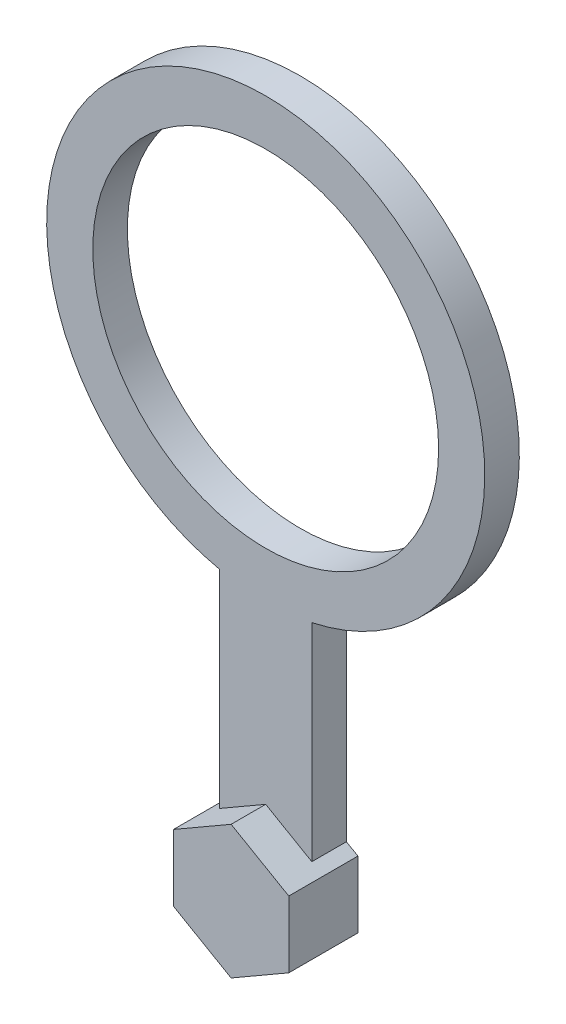
ISO-10303-21;
HEADER;
FILE_DESCRIPTION(('STEP AP214'),'2;1');
FILE_NAME('part.step','',(''),(''),'','','');
FILE_SCHEMA(('AUTOMOTIVE_DESIGN { 1 0 10303 214 1 1 1 1 }'));
ENDSEC;
DATA;
#1=APPLICATION_CONTEXT('core data for automotive mechanical design processes');
#2=APPLICATION_PROTOCOL_DEFINITION('international standard','automotive_design',2000,#1);
#3=PRODUCT_CONTEXT('',#1,'mechanical');
#4=PRODUCT('Part','Part','',(#3));
#5=PRODUCT_RELATED_PRODUCT_CATEGORY('part','',(#4));
#6=PRODUCT_DEFINITION_FORMATION('','',#4);
#7=PRODUCT_DEFINITION_CONTEXT('part definition',#1,'design');
#8=PRODUCT_DEFINITION('design','',#6,#7);
#9=PRODUCT_DEFINITION_SHAPE('','',#8);
#10=(LENGTH_UNIT() NAMED_UNIT(*) SI_UNIT(.MILLI.,.METRE.));
#11=(NAMED_UNIT(*) PLANE_ANGLE_UNIT() SI_UNIT($,.RADIAN.));
#12=(NAMED_UNIT(*) SI_UNIT($,.STERADIAN.) SOLID_ANGLE_UNIT());
#13=UNCERTAINTY_MEASURE_WITH_UNIT(LENGTH_MEASURE(1.E-05),#10,'distance_accuracy_value','');
#14=(GEOMETRIC_REPRESENTATION_CONTEXT(3) GLOBAL_UNCERTAINTY_ASSIGNED_CONTEXT((#13)) GLOBAL_UNIT_ASSIGNED_CONTEXT((#10,
#11,#12)) REPRESENTATION_CONTEXT('',''));
#15=CARTESIAN_POINT('',(0.,0.,0.));
#16=DIRECTION('',(0.,0.,1.));
#17=DIRECTION('',(1.,0.,0.));
#18=AXIS2_PLACEMENT_3D('',#15,#16,#17);
#19=CARTESIAN_POINT('',(5.,0.,3.));
#20=DIRECTION('',(-1.,0.,0.));
#21=DIRECTION('',(0.,-1.,0.));
#22=AXIS2_PLACEMENT_3D('',#19,#20,#21);
#23=PLANE('',#22);
#24=DIRECTION('',(0.,1.,0.));
#25=VECTOR('',#24,1.);
#26=CARTESIAN_POINT('',(5.,0.,0.));
#27=LINE('',#26,#25);
#28=CARTESIAN_POINT('',(5.,-2.88675134594813,0.));
#29=VERTEX_POINT('',#28);
#30=CARTESIAN_POINT('',(5.,2.88675134594813,0.));
#31=VERTEX_POINT('',#30);
#32=EDGE_CURVE('E169',#29,#31,#27,.T.);
#33=ORIENTED_EDGE('',*,*,#32,.T.);
#34=DIRECTION('',(0.,0.,-1.));
#35=VECTOR('',#34,1.);
#36=CARTESIAN_POINT('',(5.,2.88675134594813,3.));
#37=LINE('',#36,#35);
#38=CARTESIAN_POINT('',(5.,2.88675134594813,6.));
#39=VERTEX_POINT('',#38);
#40=EDGE_CURVE('E44',#39,#31,#37,.T.);
#41=ORIENTED_EDGE('',*,*,#40,.F.);
#42=DIRECTION('',(0.,1.,0.));
#43=VECTOR('',#42,1.);
#44=CARTESIAN_POINT('',(5.,-2.88675134594813,6.));
#45=LINE('',#44,#43);
#46=CARTESIAN_POINT('',(5.,-2.88675134594813,6.));
#47=VERTEX_POINT('',#46);
#48=EDGE_CURVE('E141',#47,#39,#45,.T.);
#49=ORIENTED_EDGE('',*,*,#48,.F.);
#50=DIRECTION('',(0.,0.,-1.));
#51=VECTOR('',#50,1.);
#52=CARTESIAN_POINT('',(5.,-2.88675134594813,3.));
#53=LINE('',#52,#51);
#54=EDGE_CURVE('E132',#47,#29,#53,.T.);
#55=ORIENTED_EDGE('',*,*,#54,.T.);
#56=EDGE_LOOP('',(#33,#41,#49,#55));
#57=FACE_BOUND('',#56,.T.);
#58=ADVANCED_FACE('F41',(#57),#23,.F.);
#59=CARTESIAN_POINT('',(2.5,4.3301270189222,3.));
#60=DIRECTION('',(-0.5,-0.866025403784439,0.));
#61=DIRECTION('',(0.866025403784439,-0.5,0.));
#62=AXIS2_PLACEMENT_3D('',#59,#60,#61);
#63=PLANE('',#62);
#64=DIRECTION('',(-0.866025403784439,0.5,0.));
#65=VECTOR('',#64,1.);
#66=CARTESIAN_POINT('',(2.5,4.3301270189222,0.));
#67=LINE('',#66,#65);
#68=CARTESIAN_POINT('',(4.,3.46410161513776,0.));
#69=VERTEX_POINT('',#68);
#70=EDGE_CURVE('E187',#31,#69,#67,.T.);
#71=ORIENTED_EDGE('',*,*,#70,.T.);
#72=DIRECTION('',(0.,0.,-1.));
#73=VECTOR('',#72,1.);
#74=CARTESIAN_POINT('',(4.,3.46410161513776,3.));
#75=LINE('',#74,#73);
#76=CARTESIAN_POINT('',(4.,3.46410161513776,3.));
#77=VERTEX_POINT('',#76);
#78=EDGE_CURVE('E230',#77,#69,#75,.T.);
#79=ORIENTED_EDGE('',*,*,#78,.F.);
#80=DIRECTION('',(-0.866025403784439,0.499999999999999,0.));
#81=VECTOR('',#80,1.);
#82=CARTESIAN_POINT('',(5.,2.88675134594813,3.));
#83=LINE('',#82,#81);
#84=CARTESIAN_POINT('',(0.,5.77350269189626,3.));
#85=VERTEX_POINT('',#84);
#86=EDGE_CURVE('E11',#77,#85,#83,.T.);
#87=ORIENTED_EDGE('',*,*,#86,.T.);
#88=DIRECTION('',(0.,0.,-1.));
#89=VECTOR('',#88,1.);
#90=CARTESIAN_POINT('',(0.,5.77350269189626,6.));
#91=LINE('',#90,#89);
#92=CARTESIAN_POINT('',(0.,5.77350269189626,6.));
#93=VERTEX_POINT('',#92);
#94=EDGE_CURVE('E164',#93,#85,#91,.T.);
#95=ORIENTED_EDGE('',*,*,#94,.F.);
#96=DIRECTION('',(-0.866025403784439,0.499999999999999,0.));
#97=VECTOR('',#96,1.);
#98=CARTESIAN_POINT('',(5.,2.88675134594813,6.));
#99=LINE('',#98,#97);
#100=EDGE_CURVE('E157',#39,#93,#99,.T.);
#101=ORIENTED_EDGE('',*,*,#100,.F.);
#102=ORIENTED_EDGE('',*,*,#40,.T.);
#103=EDGE_LOOP('',(#71,#79,#87,#95,#101,#102));
#104=FACE_BOUND('',#103,.T.);
#105=ADVANCED_FACE('F240',(#104),#63,.F.);
#106=CARTESIAN_POINT('',(4.,0.,3.));
#107=DIRECTION('',(-1.,0.,0.));
#108=DIRECTION('',(0.,-1.,0.));
#109=AXIS2_PLACEMENT_3D('',#106,#107,#108);
#110=PLANE('',#109);
#111=DIRECTION('',(0.,1.,0.));
#112=VECTOR('',#111,1.);
#113=CARTESIAN_POINT('',(4.,0.,0.));
#114=LINE('',#113,#112);
#115=CARTESIAN_POINT('',(4.,21.4258243789933,0.));
#116=VERTEX_POINT('',#115);
#117=EDGE_CURVE('E190',#69,#116,#114,.T.);
#118=ORIENTED_EDGE('',*,*,#117,.T.);
#119=DIRECTION('',(0.,0.,-1.));
#120=VECTOR('',#119,1.);
#121=CARTESIAN_POINT('',(4.,21.4258243789933,3.));
#122=LINE('',#121,#120);
#123=CARTESIAN_POINT('',(4.,21.4258243789933,3.));
#124=VERTEX_POINT('',#123);
#125=EDGE_CURVE('E227',#124,#116,#122,.T.);
#126=ORIENTED_EDGE('',*,*,#125,.F.);
#127=DIRECTION('',(0.,1.,0.));
#128=VECTOR('',#127,1.);
#129=CARTESIAN_POINT('',(4.,0.,3.));
#130=LINE('',#129,#128);
#131=EDGE_CURVE('E170',#77,#124,#130,.T.);
#132=ORIENTED_EDGE('',*,*,#131,.F.);
#133=ORIENTED_EDGE('',*,*,#78,.T.);
#134=EDGE_LOOP('',(#118,#126,#132,#133));
#135=FACE_BOUND('',#134,.T.);
#136=ADVANCED_FACE('F249',(#135),#110,.F.);
#137=CARTESIAN_POINT('',(0.,40.,3.));
#138=DIRECTION('',(0.,0.,-1.));
#139=DIRECTION('',(-1.,0.,0.));
#140=AXIS2_PLACEMENT_3D('',#137,#138,#139);
#141=CYLINDRICAL_SURFACE('',#140,19.);
#142=CARTESIAN_POINT('',(0.,40.,0.));
#143=DIRECTION('',(0.,0.,1.));
#144=DIRECTION('',(1.,0.,0.));
#145=AXIS2_PLACEMENT_3D('',#142,#143,#144);
#146=CIRCLE('',#145,19.);
#147=CARTESIAN_POINT('',(-4.,21.4258243789933,0.));
#148=VERTEX_POINT('',#147);
#149=EDGE_CURVE('E193',#116,#148,#146,.T.);
#150=ORIENTED_EDGE('',*,*,#149,.T.);
#151=DIRECTION('',(0.,0.,-1.));
#152=VECTOR('',#151,1.);
#153=CARTESIAN_POINT('',(-4.,21.4258243789933,3.));
#154=LINE('',#153,#152);
#155=CARTESIAN_POINT('',(-4.,21.4258243789933,3.));
#156=VERTEX_POINT('',#155);
#157=EDGE_CURVE('E224',#156,#148,#154,.T.);
#158=ORIENTED_EDGE('',*,*,#157,.F.);
#159=CARTESIAN_POINT('',(0.,40.,3.));
#160=DIRECTION('',(0.,0.,1.));
#161=DIRECTION('',(1.,0.,0.));
#162=AXIS2_PLACEMENT_3D('',#159,#160,#161);
#163=CIRCLE('',#162,19.);
#164=EDGE_CURVE('E173',#124,#156,#163,.T.);
#165=ORIENTED_EDGE('',*,*,#164,.F.);
#166=ORIENTED_EDGE('',*,*,#125,.T.);
#167=EDGE_LOOP('',(#150,#158,#165,#166));
#168=FACE_BOUND('',#167,.T.);
#169=ADVANCED_FACE('F252',(#168),#141,.T.);
#170=CARTESIAN_POINT('',(-4.,0.,3.));
#171=DIRECTION('',(-1.,0.,0.));
#172=DIRECTION('',(0.,0.,1.));
#173=AXIS2_PLACEMENT_3D('',#170,#171,#172);
#174=PLANE('',#173);
#175=DIRECTION('',(0.,1.,0.));
#176=VECTOR('',#175,1.);
#177=CARTESIAN_POINT('',(-4.,0.,0.));
#178=LINE('',#177,#176);
#179=CARTESIAN_POINT('',(-4.,3.46410161513775,0.));
#180=VERTEX_POINT('',#179);
#181=EDGE_CURVE('E197',#180,#148,#178,.T.);
#182=ORIENTED_EDGE('',*,*,#181,.F.);
#183=DIRECTION('',(0.,0.,-1.));
#184=VECTOR('',#183,1.);
#185=CARTESIAN_POINT('',(-4.,3.46410161513775,3.));
#186=LINE('',#185,#184);
#187=CARTESIAN_POINT('',(-4.,3.46410161513775,3.));
#188=VERTEX_POINT('',#187);
#189=EDGE_CURVE('E59',#188,#180,#186,.T.);
#190=ORIENTED_EDGE('',*,*,#189,.F.);
#191=DIRECTION('',(0.,1.,0.));
#192=VECTOR('',#191,1.);
#193=CARTESIAN_POINT('',(-4.,0.,3.));
#194=LINE('',#193,#192);
#195=EDGE_CURVE('E177',#188,#156,#194,.T.);
#196=ORIENTED_EDGE('',*,*,#195,.T.);
#197=ORIENTED_EDGE('',*,*,#157,.T.);
#198=EDGE_LOOP('',(#182,#190,#196,#197));
#199=FACE_BOUND('',#198,.T.);
#200=ADVANCED_FACE('F263',(#199),#174,.T.);
#201=CARTESIAN_POINT('',(-2.5,4.33012701892219,3.));
#202=DIRECTION('',(0.5,-0.866025403784439,0.));
#203=DIRECTION('',(0.866025403784439,0.5,0.));
#204=AXIS2_PLACEMENT_3D('',#201,#202,#203);
#205=PLANE('',#204);
#206=DIRECTION('',(-0.866025403784439,-0.5,0.));
#207=VECTOR('',#206,1.);
#208=CARTESIAN_POINT('',(-2.5,4.33012701892219,0.));
#209=LINE('',#208,#207);
#210=CARTESIAN_POINT('',(-5.,2.88675134594813,0.));
#211=VERTEX_POINT('',#210);
#212=EDGE_CURVE('E201',#180,#211,#209,.T.);
#213=ORIENTED_EDGE('',*,*,#212,.T.);
#214=DIRECTION('',(0.,0.,-1.));
#215=VECTOR('',#214,1.);
#216=CARTESIAN_POINT('',(-5.,2.88675134594813,3.));
#217=LINE('',#216,#215);
#218=CARTESIAN_POINT('',(-5.,2.88675134594813,6.));
#219=VERTEX_POINT('',#218);
#220=EDGE_CURVE('E218',#219,#211,#217,.T.);
#221=ORIENTED_EDGE('',*,*,#220,.F.);
#222=DIRECTION('',(-0.866025403784438,-0.500000000000001,0.));
#223=VECTOR('',#222,1.);
#224=CARTESIAN_POINT('',(0.,5.77350269189626,6.));
#225=LINE('',#224,#223);
#226=EDGE_CURVE('E160',#93,#219,#225,.T.);
#227=ORIENTED_EDGE('',*,*,#226,.F.);
#228=ORIENTED_EDGE('',*,*,#94,.T.);
#229=DIRECTION('',(-0.866025403784438,-0.500000000000001,0.));
#230=VECTOR('',#229,1.);
#231=CARTESIAN_POINT('',(0.,5.77350269189626,3.));
#232=LINE('',#231,#230);
#233=EDGE_CURVE('E149',#85,#188,#232,.T.);
#234=ORIENTED_EDGE('',*,*,#233,.T.);
#235=ORIENTED_EDGE('',*,*,#189,.T.);
#236=EDGE_LOOP('',(#213,#221,#227,#228,#234,#235));
#237=FACE_BOUND('',#236,.T.);
#238=ADVANCED_FACE('F257',(#237),#205,.F.);
#239=CARTESIAN_POINT('',(-5.,0.,3.));
#240=DIRECTION('',(1.,0.,0.));
#241=DIRECTION('',(0.,1.,0.));
#242=AXIS2_PLACEMENT_3D('',#239,#240,#241);
#243=PLANE('',#242);
#244=DIRECTION('',(0.,-1.,0.));
#245=VECTOR('',#244,1.);
#246=CARTESIAN_POINT('',(-5.,0.,0.));
#247=LINE('',#246,#245);
#248=CARTESIAN_POINT('',(-5.,-2.88675134594813,0.));
#249=VERTEX_POINT('',#248);
#250=EDGE_CURVE('E204',#211,#249,#247,.T.);
#251=ORIENTED_EDGE('',*,*,#250,.T.);
#252=DIRECTION('',(0.,0.,-1.));
#253=VECTOR('',#252,1.);
#254=CARTESIAN_POINT('',(-5.,-2.88675134594813,3.));
#255=LINE('',#254,#253);
#256=CARTESIAN_POINT('',(-5.,-2.88675134594813,6.));
#257=VERTEX_POINT('',#256);
#258=EDGE_CURVE('E131',#257,#249,#255,.T.);
#259=ORIENTED_EDGE('',*,*,#258,.F.);
#260=DIRECTION('',(0.,-1.,0.));
#261=VECTOR('',#260,1.);
#262=CARTESIAN_POINT('',(-5.,2.88675134594813,6.));
#263=LINE('',#262,#261);
#264=EDGE_CURVE('E147',#219,#257,#263,.T.);
#265=ORIENTED_EDGE('',*,*,#264,.F.);
#266=ORIENTED_EDGE('',*,*,#220,.T.);
#267=EDGE_LOOP('',(#251,#259,#265,#266));
#268=FACE_BOUND('',#267,.T.);
#269=ADVANCED_FACE('F261',(#268),#243,.F.);
#270=CARTESIAN_POINT('',(-2.5,-4.33012701892219,3.));
#271=DIRECTION('',(0.5,0.866025403784439,0.));
#272=DIRECTION('',(-0.866025403784439,0.5,0.));
#273=AXIS2_PLACEMENT_3D('',#270,#271,#272);
#274=PLANE('',#273);
#275=DIRECTION('',(0.866025403784439,-0.5,0.));
#276=VECTOR('',#275,1.);
#277=CARTESIAN_POINT('',(-2.5,-4.33012701892219,0.));
#278=LINE('',#277,#276);
#279=CARTESIAN_POINT('',(0.,-5.77350269189626,0.));
#280=VERTEX_POINT('',#279);
#281=EDGE_CURVE('E92',#249,#280,#278,.T.);
#282=ORIENTED_EDGE('',*,*,#281,.T.);
#283=DIRECTION('',(0.,0.,-1.));
#284=VECTOR('',#283,1.);
#285=CARTESIAN_POINT('',(0.,-5.77350269189626,3.));
#286=LINE('',#285,#284);
#287=CARTESIAN_POINT('',(0.,-5.77350269189626,6.));
#288=VERTEX_POINT('',#287);
#289=EDGE_CURVE('E125',#288,#280,#286,.T.);
#290=ORIENTED_EDGE('',*,*,#289,.F.);
#291=DIRECTION('',(0.866025403784439,-0.5,0.));
#292=VECTOR('',#291,1.);
#293=CARTESIAN_POINT('',(-5.,-2.88675134594813,6.));
#294=LINE('',#293,#292);
#295=EDGE_CURVE('E129',#257,#288,#294,.T.);
#296=ORIENTED_EDGE('',*,*,#295,.F.);
#297=ORIENTED_EDGE('',*,*,#258,.T.);
#298=EDGE_LOOP('',(#282,#290,#296,#297));
#299=FACE_BOUND('',#298,.T.);
#300=ADVANCED_FACE('F127',(#299),#274,.F.);
#301=CARTESIAN_POINT('',(2.5,-4.33012701892219,3.));
#302=DIRECTION('',(-0.5,0.866025403784438,0.));
#303=DIRECTION('',(-0.866025403784439,-0.5,0.));
#304=AXIS2_PLACEMENT_3D('',#301,#302,#303);
#305=PLANE('',#304);
#306=DIRECTION('',(0.866025403784439,0.5,0.));
#307=VECTOR('',#306,1.);
#308=CARTESIAN_POINT('',(2.5,-4.33012701892219,0.));
#309=LINE('',#308,#307);
#310=EDGE_CURVE('E99',#280,#29,#309,.T.);
#311=ORIENTED_EDGE('',*,*,#310,.T.);
#312=ORIENTED_EDGE('',*,*,#54,.F.);
#313=DIRECTION('',(0.866025403784438,0.5,0.));
#314=VECTOR('',#313,1.);
#315=CARTESIAN_POINT('',(0.,-5.77350269189626,6.));
#316=LINE('',#315,#314);
#317=EDGE_CURVE('E135',#288,#47,#316,.T.);
#318=ORIENTED_EDGE('',*,*,#317,.F.);
#319=ORIENTED_EDGE('',*,*,#289,.T.);
#320=EDGE_LOOP('',(#311,#312,#318,#319));
#321=FACE_BOUND('',#320,.T.);
#322=ADVANCED_FACE('F136',(#321),#305,.F.);
#323=CARTESIAN_POINT('',(0.,40.,3.));
#324=DIRECTION('',(0.,0.,-1.));
#325=DIRECTION('',(-1.,0.,0.));
#326=AXIS2_PLACEMENT_3D('',#323,#324,#325);
#327=CYLINDRICAL_SURFACE('',#326,15.);
#328=CARTESIAN_POINT('',(0.,40.,3.));
#329=DIRECTION('',(0.,0.,1.));
#330=DIRECTION('',(1.,0.,0.));
#331=AXIS2_PLACEMENT_3D('',#328,#329,#330);
#332=CIRCLE('',#331,15.);
#333=CARTESIAN_POINT('',(15.,40.,3.));
#334=VERTEX_POINT('',#333);
#335=EDGE_CURVE('E180',#334,#334,#332,.T.);
#336=ORIENTED_EDGE('',*,*,#335,.T.);
#337=EDGE_LOOP('',(#336));
#338=FACE_BOUND('',#337,.T.);
#339=CARTESIAN_POINT('',(0.,40.,0.));
#340=DIRECTION('',(0.,0.,1.));
#341=DIRECTION('',(1.,0.,0.));
#342=AXIS2_PLACEMENT_3D('',#339,#340,#341);
#343=CIRCLE('',#342,15.);
#344=CARTESIAN_POINT('',(15.,40.,0.));
#345=VERTEX_POINT('',#344);
#346=EDGE_CURVE('E174',#345,#345,#343,.T.);
#347=ORIENTED_EDGE('',*,*,#346,.F.);
#348=EDGE_LOOP('',(#347));
#349=FACE_BOUND('',#348,.T.);
#350=ADVANCED_FACE('F307',(#338,#349),#327,.F.);
#351=CARTESIAN_POINT('',(0.,0.,3.));
#352=DIRECTION('',(0.,0.,1.));
#353=DIRECTION('',(1.,0.,0.));
#354=AXIS2_PLACEMENT_3D('',#351,#352,#353);
#355=PLANE('',#354);
#356=ORIENTED_EDGE('',*,*,#233,.F.);
#357=ORIENTED_EDGE('',*,*,#86,.F.);
#358=ORIENTED_EDGE('',*,*,#131,.T.);
#359=ORIENTED_EDGE('',*,*,#164,.T.);
#360=ORIENTED_EDGE('',*,*,#195,.F.);
#361=EDGE_LOOP('',(#356,#357,#358,#359,#360));
#362=FACE_BOUND('',#361,.T.);
#363=ORIENTED_EDGE('',*,*,#335,.F.);
#364=EDGE_LOOP('',(#363));
#365=FACE_BOUND('',#364,.T.);
#366=ADVANCED_FACE('F254',(#362,#365),#355,.T.);
#367=CARTESIAN_POINT('',(0.,0.,0.));
#368=DIRECTION('',(0.,0.,1.));
#369=DIRECTION('',(1.,0.,0.));
#370=AXIS2_PLACEMENT_3D('',#367,#368,#369);
#371=PLANE('',#370);
#372=ORIENTED_EDGE('',*,*,#32,.F.);
#373=ORIENTED_EDGE('',*,*,#310,.F.);
#374=ORIENTED_EDGE('',*,*,#281,.F.);
#375=ORIENTED_EDGE('',*,*,#250,.F.);
#376=ORIENTED_EDGE('',*,*,#212,.F.);
#377=ORIENTED_EDGE('',*,*,#181,.T.);
#378=ORIENTED_EDGE('',*,*,#149,.F.);
#379=ORIENTED_EDGE('',*,*,#117,.F.);
#380=ORIENTED_EDGE('',*,*,#70,.F.);
#381=EDGE_LOOP('',(#372,#373,#374,#375,#376,#377,#378,#379,#380));
#382=FACE_BOUND('',#381,.T.);
#383=ORIENTED_EDGE('',*,*,#346,.T.);
#384=EDGE_LOOP('',(#383));
#385=FACE_BOUND('',#384,.T.);
#386=ADVANCED_FACE('F245',(#382,#385),#371,.F.);
#387=CARTESIAN_POINT('',(0.,0.,6.));
#388=DIRECTION('',(0.,0.,1.));
#389=DIRECTION('',(1.,0.,0.));
#390=AXIS2_PLACEMENT_3D('',#387,#388,#389);
#391=PLANE('',#390);
#392=ORIENTED_EDGE('',*,*,#295,.T.);
#393=ORIENTED_EDGE('',*,*,#317,.T.);
#394=ORIENTED_EDGE('',*,*,#48,.T.);
#395=ORIENTED_EDGE('',*,*,#100,.T.);
#396=ORIENTED_EDGE('',*,*,#226,.T.);
#397=ORIENTED_EDGE('',*,*,#264,.T.);
#398=EDGE_LOOP('',(#392,#393,#394,#395,#396,#397));
#399=FACE_BOUND('',#398,.T.);
#400=ADVANCED_FACE('F144',(#399),#391,.T.);
#401=CLOSED_SHELL('',(#58,#105,#136,#169,#200,#238,#269,#300,#322,#350,#366,#386,#400));
#402=MANIFOLD_SOLID_BREP('B2',#401);
#403=ADVANCED_BREP_SHAPE_REPRESENTATION('',(#18,#402),#14);
#404=SHAPE_DEFINITION_REPRESENTATION(#9,#403);
ENDSEC;
END-ISO-10303-21;
